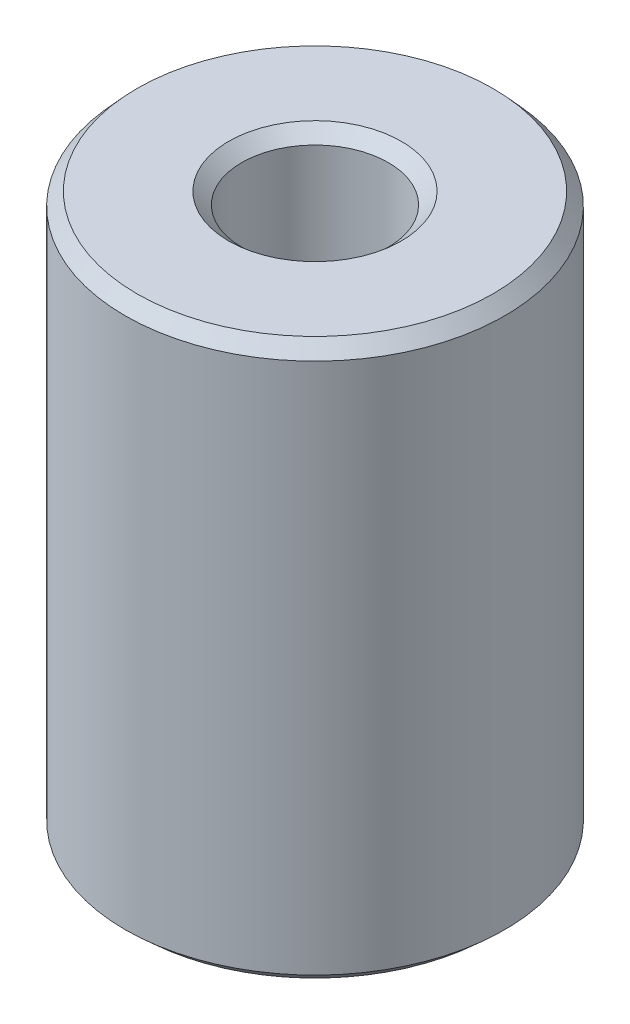
ISO-10303-21;
HEADER;
FILE_DESCRIPTION(('STEP AP214'),'2;1');
FILE_NAME('part.step','',(''),(''),'','','');
FILE_SCHEMA(('AUTOMOTIVE_DESIGN { 1 0 10303 214 1 1 1 1 }'));
ENDSEC;
DATA;
#1=APPLICATION_CONTEXT('core data for automotive mechanical design processes');
#2=APPLICATION_PROTOCOL_DEFINITION('international standard','automotive_design',2000,#1);
#3=PRODUCT_CONTEXT('',#1,'mechanical');
#4=PRODUCT('Part','Part','',(#3));
#5=PRODUCT_RELATED_PRODUCT_CATEGORY('part','',(#4));
#6=PRODUCT_DEFINITION_FORMATION('','',#4);
#7=PRODUCT_DEFINITION_CONTEXT('part definition',#1,'design');
#8=PRODUCT_DEFINITION('design','',#6,#7);
#9=PRODUCT_DEFINITION_SHAPE('','',#8);
#10=(LENGTH_UNIT() NAMED_UNIT(*) SI_UNIT(.MILLI.,.METRE.));
#11=(NAMED_UNIT(*) PLANE_ANGLE_UNIT() SI_UNIT($,.RADIAN.));
#12=(NAMED_UNIT(*) SI_UNIT($,.STERADIAN.) SOLID_ANGLE_UNIT());
#13=UNCERTAINTY_MEASURE_WITH_UNIT(LENGTH_MEASURE(1.E-05),#10,'distance_accuracy_value','');
#14=(GEOMETRIC_REPRESENTATION_CONTEXT(3) GLOBAL_UNCERTAINTY_ASSIGNED_CONTEXT((#13)) GLOBAL_UNIT_ASSIGNED_CONTEXT((#10,
#11,#12)) REPRESENTATION_CONTEXT('',''));
#15=CARTESIAN_POINT('',(0.,0.,0.));
#16=DIRECTION('',(0.,0.,1.));
#17=DIRECTION('',(1.,0.,0.));
#18=AXIS2_PLACEMENT_3D('',#15,#16,#17);
#19=CARTESIAN_POINT('',(0.,51.3254096924979,0.));
#20=DIRECTION('',(0.,-1.,0.));
#21=DIRECTION('',(0.,0.,-1.));
#22=AXIS2_PLACEMENT_3D('',#19,#20,#21);
#23=CYLINDRICAL_SURFACE('',#22,17.5);
#24=CARTESIAN_POINT('',(0.,1.09137758012399,0.));
#25=DIRECTION('',(0.,1.,0.));
#26=DIRECTION('',(0.,0.,1.));
#27=AXIS2_PLACEMENT_3D('',#24,#25,#26);
#28=CIRCLE('',#27,17.5);
#29=CARTESIAN_POINT('',(0.,1.09137758012399,17.5));
#30=VERTEX_POINT('',#29);
#31=EDGE_CURVE('E10',#30,#30,#28,.T.);
#32=ORIENTED_EDGE('',*,*,#31,.T.);
#33=EDGE_LOOP('',(#32));
#34=FACE_BOUND('',#33,.T.);
#35=CARTESIAN_POINT('',(0.,50.1200944608761,0.));
#36=DIRECTION('',(0.,1.,0.));
#37=DIRECTION('',(0.,0.,1.));
#38=AXIS2_PLACEMENT_3D('',#35,#36,#37);
#39=CIRCLE('',#38,17.5);
#40=CARTESIAN_POINT('',(0.,50.1200944608761,17.5));
#41=VERTEX_POINT('',#40);
#42=EDGE_CURVE('E50',#41,#41,#39,.F.);
#43=ORIENTED_EDGE('',*,*,#42,.T.);
#44=EDGE_LOOP('',(#43));
#45=FACE_BOUND('',#44,.T.);
#46=ADVANCED_FACE('F39',(#34,#45),#23,.T.);
#47=CARTESIAN_POINT('',(0.,51.3254096924979,0.));
#48=DIRECTION('',(0.,1.,0.));
#49=DIRECTION('',(0.,0.,1.));
#50=AXIS2_PLACEMENT_3D('',#47,#48,#49);
#51=PLANE('',#50);
#52=CARTESIAN_POINT('',(0.,51.3254096924979,0.));
#53=DIRECTION('',(0.,1.,0.));
#54=DIRECTION('',(0.,0.,1.));
#55=AXIS2_PLACEMENT_3D('',#52,#53,#54);
#56=CIRCLE('',#55,7.96420975454008);
#57=CARTESIAN_POINT('',(0.,51.3254096924979,7.96420975454008));
#58=VERTEX_POINT('',#57);
#59=EDGE_CURVE('E58',#58,#58,#56,.F.);
#60=ORIENTED_EDGE('',*,*,#59,.T.);
#61=EDGE_LOOP('',(#60));
#62=FACE_BOUND('',#61,.T.);
#63=CARTESIAN_POINT('',(0.,51.3254096924979,0.));
#64=DIRECTION('',(0.,1.,0.));
#65=DIRECTION('',(0.,0.,1.));
#66=AXIS2_PLACEMENT_3D('',#63,#64,#65);
#67=CIRCLE('',#66,16.408622419876);
#68=CARTESIAN_POINT('',(0.,51.3254096924979,16.408622419876));
#69=VERTEX_POINT('',#68);
#70=EDGE_CURVE('E61',#69,#69,#67,.T.);
#71=ORIENTED_EDGE('',*,*,#70,.T.);
#72=EDGE_LOOP('',(#71));
#73=FACE_BOUND('',#72,.T.);
#74=ADVANCED_FACE('F88',(#62,#73),#51,.T.);
#75=CARTESIAN_POINT('',(0.,0.,0.));
#76=DIRECTION('',(0.,1.,0.));
#77=DIRECTION('',(0.,0.,1.));
#78=AXIS2_PLACEMENT_3D('',#75,#76,#77);
#79=PLANE('',#78);
#80=CARTESIAN_POINT('',(0.,0.,0.));
#81=DIRECTION('',(0.,1.,0.));
#82=DIRECTION('',(0.,0.,1.));
#83=AXIS2_PLACEMENT_3D('',#80,#81,#82);
#84=CIRCLE('',#83,7.85027210304223);
#85=CARTESIAN_POINT('',(0.,0.,7.85027210304223));
#86=VERTEX_POINT('',#85);
#87=EDGE_CURVE('E51',#86,#86,#84,.T.);
#88=ORIENTED_EDGE('',*,*,#87,.T.);
#89=EDGE_LOOP('',(#88));
#90=FACE_BOUND('',#89,.T.);
#91=CARTESIAN_POINT('',(0.,0.,0.));
#92=DIRECTION('',(0.,1.,0.));
#93=DIRECTION('',(0.,0.,1.));
#94=AXIS2_PLACEMENT_3D('',#91,#92,#93);
#95=CIRCLE('',#94,16.2946847683782);
#96=CARTESIAN_POINT('',(0.,0.,16.2946847683782));
#97=VERTEX_POINT('',#96);
#98=EDGE_CURVE('E54',#97,#97,#95,.F.);
#99=ORIENTED_EDGE('',*,*,#98,.T.);
#100=EDGE_LOOP('',(#99));
#101=FACE_BOUND('',#100,.T.);
#102=ADVANCED_FACE('F83',(#90,#101),#79,.F.);
#103=CARTESIAN_POINT('',(0.,51.3254096924979,0.));
#104=DIRECTION('',(0.,-1.,0.));
#105=DIRECTION('',(0.,0.,-1.));
#106=AXIS2_PLACEMENT_3D('',#103,#104,#105);
#107=CYLINDRICAL_SURFACE('',#106,6.75889452291826);
#108=CARTESIAN_POINT('',(0.,50.2340321123739,0.));
#109=DIRECTION('',(0.,1.,0.));
#110=DIRECTION('',(0.,0.,1.));
#111=AXIS2_PLACEMENT_3D('',#108,#109,#110);
#112=CIRCLE('',#111,6.75889452291826);
#113=CARTESIAN_POINT('',(0.,50.2340321123739,6.75889452291826));
#114=VERTEX_POINT('',#113);
#115=EDGE_CURVE('E67',#114,#114,#112,.T.);
#116=ORIENTED_EDGE('',*,*,#115,.T.);
#117=EDGE_LOOP('',(#116));
#118=FACE_BOUND('',#117,.T.);
#119=CARTESIAN_POINT('',(0.,1.20531523162182,0.));
#120=DIRECTION('',(0.,1.,0.));
#121=DIRECTION('',(0.,0.,1.));
#122=AXIS2_PLACEMENT_3D('',#119,#120,#121);
#123=CIRCLE('',#122,6.75889452291826);
#124=CARTESIAN_POINT('',(0.,1.20531523162182,6.75889452291826));
#125=VERTEX_POINT('',#124);
#126=EDGE_CURVE('E69',#125,#125,#123,.F.);
#127=ORIENTED_EDGE('',*,*,#126,.T.);
#128=EDGE_LOOP('',(#127));
#129=FACE_BOUND('',#128,.T.);
#130=ADVANCED_FACE('F71',(#118,#129),#107,.F.);
#131=CARTESIAN_POINT('',(0.,50.2340321123739,0.));
#132=DIRECTION('',(0.,1.,0.));
#133=DIRECTION('',(0.,0.,1.));
#134=AXIS2_PLACEMENT_3D('',#131,#132,#133);
#135=CONICAL_SURFACE('',#134,6.75889452291826,0.834966968666364);
#136=ORIENTED_EDGE('',*,*,#59,.F.);
#137=EDGE_LOOP('',(#136));
#138=FACE_BOUND('',#137,.T.);
#139=ORIENTED_EDGE('',*,*,#115,.F.);
#140=EDGE_LOOP('',(#139));
#141=FACE_BOUND('',#140,.T.);
#142=ADVANCED_FACE('F77',(#138,#141),#135,.F.);
#143=CARTESIAN_POINT('',(0.,0.,0.));
#144=DIRECTION('',(0.,-1.,0.));
#145=DIRECTION('',(0.,0.,-1.));
#146=AXIS2_PLACEMENT_3D('',#143,#144,#145);
#147=CONICAL_SURFACE('',#146,7.85027210304223,0.735829358128535);
#148=ORIENTED_EDGE('',*,*,#126,.F.);
#149=EDGE_LOOP('',(#148));
#150=FACE_BOUND('',#149,.T.);
#151=ORIENTED_EDGE('',*,*,#87,.F.);
#152=EDGE_LOOP('',(#151));
#153=FACE_BOUND('',#152,.T.);
#154=ADVANCED_FACE('F73',(#150,#153),#147,.F.);
#155=CARTESIAN_POINT('',(0.,1.09137758012399,0.));
#156=DIRECTION('',(0.,1.,0.));
#157=DIRECTION('',(0.,0.,1.));
#158=AXIS2_PLACEMENT_3D('',#155,#156,#157);
#159=CONICAL_SURFACE('',#158,17.5,0.834966968666361);
#160=ORIENTED_EDGE('',*,*,#98,.F.);
#161=EDGE_LOOP('',(#160));
#162=FACE_BOUND('',#161,.T.);
#163=ORIENTED_EDGE('',*,*,#31,.F.);
#164=EDGE_LOOP('',(#163));
#165=FACE_BOUND('',#164,.T.);
#166=ADVANCED_FACE('F76',(#162,#165),#159,.T.);
#167=CARTESIAN_POINT('',(0.,51.3254096924979,0.));
#168=DIRECTION('',(0.,-1.,0.));
#169=DIRECTION('',(0.,0.,-1.));
#170=AXIS2_PLACEMENT_3D('',#167,#168,#169);
#171=CONICAL_SURFACE('',#170,16.408622419876,0.735829358128535);
#172=ORIENTED_EDGE('',*,*,#42,.F.);
#173=EDGE_LOOP('',(#172));
#174=FACE_BOUND('',#173,.T.);
#175=ORIENTED_EDGE('',*,*,#70,.F.);
#176=EDGE_LOOP('',(#175));
#177=FACE_BOUND('',#176,.T.);
#178=ADVANCED_FACE('F45',(#174,#177),#171,.T.);
#179=CLOSED_SHELL('',(#46,#74,#102,#130,#142,#154,#166,#178));
#180=MANIFOLD_SOLID_BREP('B2',#179);
#181=ADVANCED_BREP_SHAPE_REPRESENTATION('',(#18,#180),#14);
#182=SHAPE_DEFINITION_REPRESENTATION(#9,#181);
ENDSEC;
END-ISO-10303-21;
